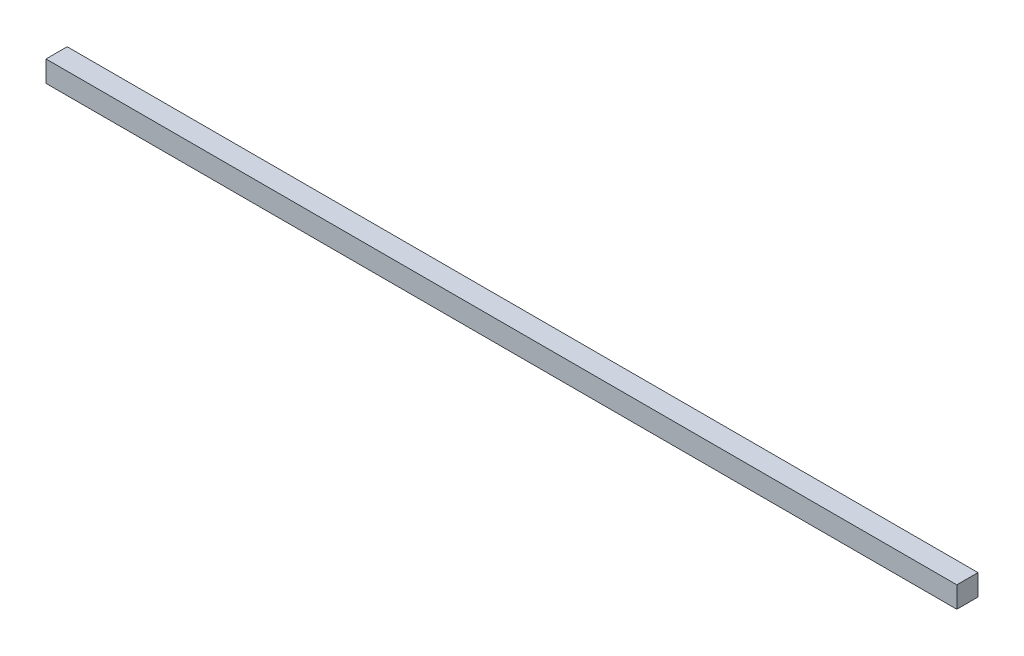
ISO-10303-21;
HEADER;
FILE_DESCRIPTION(('STEP AP214'),'2;1');
FILE_NAME('part.step','',(''),(''),'','','');
FILE_SCHEMA(('AUTOMOTIVE_DESIGN { 1 0 10303 214 1 1 1 1 }'));
ENDSEC;
DATA;
#1=APPLICATION_CONTEXT('core data for automotive mechanical design processes');
#2=APPLICATION_PROTOCOL_DEFINITION('international standard','automotive_design',2000,#1);
#3=PRODUCT_CONTEXT('',#1,'mechanical');
#4=PRODUCT('Part','Part','',(#3));
#5=PRODUCT_RELATED_PRODUCT_CATEGORY('part','',(#4));
#6=PRODUCT_DEFINITION_FORMATION('','',#4);
#7=PRODUCT_DEFINITION_CONTEXT('part definition',#1,'design');
#8=PRODUCT_DEFINITION('design','',#6,#7);
#9=PRODUCT_DEFINITION_SHAPE('','',#8);
#10=(LENGTH_UNIT() NAMED_UNIT(*) SI_UNIT(.MILLI.,.METRE.));
#11=(NAMED_UNIT(*) PLANE_ANGLE_UNIT() SI_UNIT($,.RADIAN.));
#12=(NAMED_UNIT(*) SI_UNIT($,.STERADIAN.) SOLID_ANGLE_UNIT());
#13=UNCERTAINTY_MEASURE_WITH_UNIT(LENGTH_MEASURE(1.E-05),#10,'distance_accuracy_value','');
#14=(GEOMETRIC_REPRESENTATION_CONTEXT(3) GLOBAL_UNCERTAINTY_ASSIGNED_CONTEXT((#13)) GLOBAL_UNIT_ASSIGNED_CONTEXT((#10,
#11,#12)) REPRESENTATION_CONTEXT('',''));
#15=CARTESIAN_POINT('',(0.,0.,0.));
#16=DIRECTION('',(0.,0.,1.));
#17=DIRECTION('',(1.,0.,0.));
#18=AXIS2_PLACEMENT_3D('',#15,#16,#17);
#19=CARTESIAN_POINT('',(-215.,10.,-4.99999999999999));
#20=DIRECTION('',(1.,0.,0.));
#21=DIRECTION('',(0.,0.,-1.));
#22=AXIS2_PLACEMENT_3D('',#19,#20,#21);
#23=PLANE('',#22);
#24=DIRECTION('',(0.,0.,1.));
#25=VECTOR('',#24,1.);
#26=CARTESIAN_POINT('',(-215.,0.,-4.99999999999999));
#27=LINE('',#26,#25);
#28=CARTESIAN_POINT('',(-215.,0.,-4.99999999999999));
#29=VERTEX_POINT('',#28);
#30=CARTESIAN_POINT('',(-215.,0.,5.00000000000001));
#31=VERTEX_POINT('',#30);
#32=EDGE_CURVE('E96',#29,#31,#27,.T.);
#33=ORIENTED_EDGE('',*,*,#32,.T.);
#34=DIRECTION('',(0.,-1.,0.));
#35=VECTOR('',#34,1.);
#36=CARTESIAN_POINT('',(-215.,10.,5.00000000000001));
#37=LINE('',#36,#35);
#38=CARTESIAN_POINT('',(-215.,10.,5.00000000000001));
#39=VERTEX_POINT('',#38);
#40=EDGE_CURVE('E11',#39,#31,#37,.T.);
#41=ORIENTED_EDGE('',*,*,#40,.F.);
#42=DIRECTION('',(0.,0.,1.));
#43=VECTOR('',#42,1.);
#44=CARTESIAN_POINT('',(-215.,10.,-4.99999999999999));
#45=LINE('',#44,#43);
#46=CARTESIAN_POINT('',(-215.,10.,-4.99999999999999));
#47=VERTEX_POINT('',#46);
#48=EDGE_CURVE('E84',#47,#39,#45,.T.);
#49=ORIENTED_EDGE('',*,*,#48,.F.);
#50=DIRECTION('',(0.,-1.,0.));
#51=VECTOR('',#50,1.);
#52=CARTESIAN_POINT('',(-215.,10.,-4.99999999999999));
#53=LINE('',#52,#51);
#54=EDGE_CURVE('E92',#47,#29,#53,.T.);
#55=ORIENTED_EDGE('',*,*,#54,.T.);
#56=EDGE_LOOP('',(#33,#41,#49,#55));
#57=FACE_BOUND('',#56,.T.);
#58=ADVANCED_FACE('F33',(#57),#23,.F.);
#59=CARTESIAN_POINT('',(-215.,10.,5.00000000000001));
#60=DIRECTION('',(0.,0.,-1.));
#61=DIRECTION('',(-1.,0.,0.));
#62=AXIS2_PLACEMENT_3D('',#59,#60,#61);
#63=PLANE('',#62);
#64=DIRECTION('',(1.,0.,0.));
#65=VECTOR('',#64,1.);
#66=CARTESIAN_POINT('',(-215.,0.,5.00000000000001));
#67=LINE('',#66,#65);
#68=CARTESIAN_POINT('',(215.,0.,5.00000000000001));
#69=VERTEX_POINT('',#68);
#70=EDGE_CURVE('E88',#31,#69,#67,.T.);
#71=ORIENTED_EDGE('',*,*,#70,.T.);
#72=DIRECTION('',(0.,-1.,0.));
#73=VECTOR('',#72,1.);
#74=CARTESIAN_POINT('',(215.,10.,5.00000000000001));
#75=LINE('',#74,#73);
#76=CARTESIAN_POINT('',(215.,10.,5.00000000000001));
#77=VERTEX_POINT('',#76);
#78=EDGE_CURVE('E41',#77,#69,#75,.T.);
#79=ORIENTED_EDGE('',*,*,#78,.F.);
#80=DIRECTION('',(1.,0.,0.));
#81=VECTOR('',#80,1.);
#82=CARTESIAN_POINT('',(-215.,10.,5.00000000000001));
#83=LINE('',#82,#81);
#84=EDGE_CURVE('E79',#39,#77,#83,.T.);
#85=ORIENTED_EDGE('',*,*,#84,.F.);
#86=ORIENTED_EDGE('',*,*,#40,.T.);
#87=EDGE_LOOP('',(#71,#79,#85,#86));
#88=FACE_BOUND('',#87,.T.);
#89=ADVANCED_FACE('F87',(#88),#63,.F.);
#90=CARTESIAN_POINT('',(215.,10.,-4.99999999999999));
#91=DIRECTION('',(-1.,0.,0.));
#92=DIRECTION('',(0.,0.,1.));
#93=AXIS2_PLACEMENT_3D('',#90,#91,#92);
#94=PLANE('',#93);
#95=DIRECTION('',(0.,0.,-1.));
#96=VECTOR('',#95,1.);
#97=CARTESIAN_POINT('',(215.,0.,-4.99999999999999));
#98=LINE('',#97,#96);
#99=CARTESIAN_POINT('',(215.,0.,-4.99999999999999));
#100=VERTEX_POINT('',#99);
#101=EDGE_CURVE('E66',#69,#100,#98,.T.);
#102=ORIENTED_EDGE('',*,*,#101,.T.);
#103=DIRECTION('',(0.,-1.,0.));
#104=VECTOR('',#103,1.);
#105=CARTESIAN_POINT('',(215.,10.,-4.99999999999999));
#106=LINE('',#105,#104);
#107=CARTESIAN_POINT('',(215.,10.,-4.99999999999999));
#108=VERTEX_POINT('',#107);
#109=EDGE_CURVE('E89',#108,#100,#106,.T.);
#110=ORIENTED_EDGE('',*,*,#109,.F.);
#111=DIRECTION('',(0.,0.,-1.));
#112=VECTOR('',#111,1.);
#113=CARTESIAN_POINT('',(215.,10.,-4.99999999999999));
#114=LINE('',#113,#112);
#115=EDGE_CURVE('E82',#77,#108,#114,.T.);
#116=ORIENTED_EDGE('',*,*,#115,.F.);
#117=ORIENTED_EDGE('',*,*,#78,.T.);
#118=EDGE_LOOP('',(#102,#110,#116,#117));
#119=FACE_BOUND('',#118,.T.);
#120=ADVANCED_FACE('F90',(#119),#94,.F.);
#121=CARTESIAN_POINT('',(-215.,10.,-4.99999999999999));
#122=DIRECTION('',(0.,0.,1.));
#123=DIRECTION('',(1.,0.,0.));
#124=AXIS2_PLACEMENT_3D('',#121,#122,#123);
#125=PLANE('',#124);
#126=DIRECTION('',(-1.,0.,0.));
#127=VECTOR('',#126,1.);
#128=CARTESIAN_POINT('',(-215.,0.,-4.99999999999999));
#129=LINE('',#128,#127);
#130=EDGE_CURVE('E72',#100,#29,#129,.T.);
#131=ORIENTED_EDGE('',*,*,#130,.T.);
#132=ORIENTED_EDGE('',*,*,#54,.F.);
#133=DIRECTION('',(-1.,0.,0.));
#134=VECTOR('',#133,1.);
#135=CARTESIAN_POINT('',(-215.,10.,-4.99999999999999));
#136=LINE('',#135,#134);
#137=EDGE_CURVE('E49',#108,#47,#136,.T.);
#138=ORIENTED_EDGE('',*,*,#137,.F.);
#139=ORIENTED_EDGE('',*,*,#109,.T.);
#140=EDGE_LOOP('',(#131,#132,#138,#139));
#141=FACE_BOUND('',#140,.T.);
#142=ADVANCED_FACE('F103',(#141),#125,.F.);
#143=CARTESIAN_POINT('',(0.,10.,0.));
#144=DIRECTION('',(0.,1.,0.));
#145=DIRECTION('',(0.,0.,1.));
#146=AXIS2_PLACEMENT_3D('',#143,#144,#145);
#147=PLANE('',#146);
#148=ORIENTED_EDGE('',*,*,#48,.T.);
#149=ORIENTED_EDGE('',*,*,#84,.T.);
#150=ORIENTED_EDGE('',*,*,#115,.T.);
#151=ORIENTED_EDGE('',*,*,#137,.T.);
#152=EDGE_LOOP('',(#148,#149,#150,#151));
#153=FACE_BOUND('',#152,.T.);
#154=ADVANCED_FACE('F80',(#153),#147,.T.);
#155=CARTESIAN_POINT('',(0.,0.,0.));
#156=DIRECTION('',(0.,1.,0.));
#157=DIRECTION('',(0.,0.,1.));
#158=AXIS2_PLACEMENT_3D('',#155,#156,#157);
#159=PLANE('',#158);
#160=ORIENTED_EDGE('',*,*,#32,.F.);
#161=ORIENTED_EDGE('',*,*,#130,.F.);
#162=ORIENTED_EDGE('',*,*,#101,.F.);
#163=ORIENTED_EDGE('',*,*,#70,.F.);
#164=EDGE_LOOP('',(#160,#161,#162,#163));
#165=FACE_BOUND('',#164,.T.);
#166=ADVANCED_FACE('F106',(#165),#159,.F.);
#167=CLOSED_SHELL('',(#58,#89,#120,#142,#154,#166));
#168=MANIFOLD_SOLID_BREP('B2',#167);
#169=ADVANCED_BREP_SHAPE_REPRESENTATION('',(#18,#168),#14);
#170=SHAPE_DEFINITION_REPRESENTATION(#9,#169);
ENDSEC;
END-ISO-10303-21;
